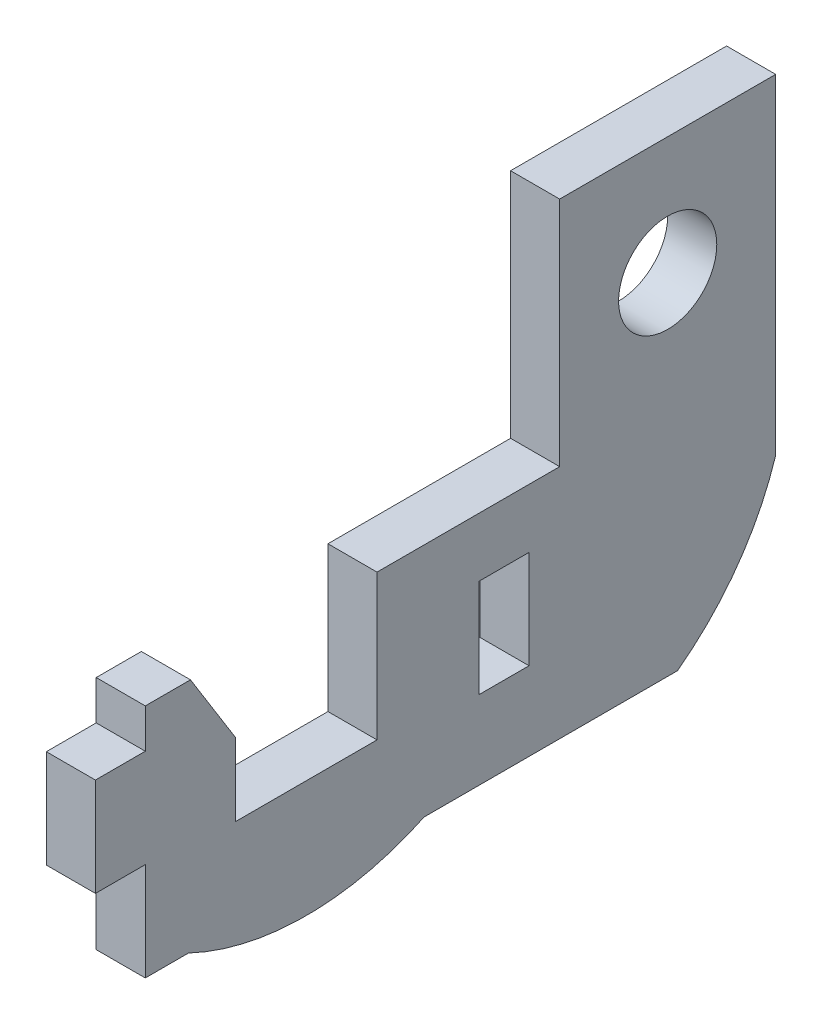
ISO-10303-21;
HEADER;
FILE_DESCRIPTION(('STEP AP214'),'2;1');
FILE_NAME('part.step','',(''),(''),'','','');
FILE_SCHEMA(('AUTOMOTIVE_DESIGN { 1 0 10303 214 1 1 1 1 }'));
ENDSEC;
DATA;
#1=APPLICATION_CONTEXT('core data for automotive mechanical design processes');
#2=APPLICATION_PROTOCOL_DEFINITION('international standard','automotive_design',2000,#1);
#3=PRODUCT_CONTEXT('',#1,'mechanical');
#4=PRODUCT('Part','Part','',(#3));
#5=PRODUCT_RELATED_PRODUCT_CATEGORY('part','',(#4));
#6=PRODUCT_DEFINITION_FORMATION('','',#4);
#7=PRODUCT_DEFINITION_CONTEXT('part definition',#1,'design');
#8=PRODUCT_DEFINITION('design','',#6,#7);
#9=PRODUCT_DEFINITION_SHAPE('','',#8);
#10=(LENGTH_UNIT() NAMED_UNIT(*) SI_UNIT(.MILLI.,.METRE.));
#11=(NAMED_UNIT(*) PLANE_ANGLE_UNIT() SI_UNIT($,.RADIAN.));
#12=(NAMED_UNIT(*) SI_UNIT($,.STERADIAN.) SOLID_ANGLE_UNIT());
#13=UNCERTAINTY_MEASURE_WITH_UNIT(LENGTH_MEASURE(1.E-05),#10,'distance_accuracy_value','');
#14=(GEOMETRIC_REPRESENTATION_CONTEXT(3) GLOBAL_UNCERTAINTY_ASSIGNED_CONTEXT((#13)) GLOBAL_UNIT_ASSIGNED_CONTEXT((#10,
#11,#12)) REPRESENTATION_CONTEXT('',''));
#15=CARTESIAN_POINT('',(0.,0.,0.));
#16=DIRECTION('',(0.,0.,1.));
#17=DIRECTION('',(1.,0.,0.));
#18=AXIS2_PLACEMENT_3D('',#15,#16,#17);
#19=CARTESIAN_POINT('',(3.175,-22.606,33.782));
#20=DIRECTION('',(0.,1.,0.));
#21=DIRECTION('',(0.,0.,1.));
#22=AXIS2_PLACEMENT_3D('',#19,#20,#21);
#23=PLANE('',#22);
#24=DIRECTION('',(0.,0.,-1.));
#25=VECTOR('',#24,1.);
#26=CARTESIAN_POINT('',(0.,-22.606,33.782));
#27=LINE('',#26,#25);
#28=CARTESIAN_POINT('',(0.,-22.606,15.748));
#29=VERTEX_POINT('',#28);
#30=CARTESIAN_POINT('',(0.,-22.606,-0.634999999999901));
#31=VERTEX_POINT('',#30);
#32=EDGE_CURVE('E194',#29,#31,#27,.T.);
#33=ORIENTED_EDGE('',*,*,#32,.T.);
#34=DIRECTION('',(-1.,0.,0.));
#35=VECTOR('',#34,1.);
#36=CARTESIAN_POINT('',(3.175,-22.606,-0.634999999999901));
#37=LINE('',#36,#35);
#38=CARTESIAN_POINT('',(3.175,-22.606,-0.634999999999901));
#39=VERTEX_POINT('',#38);
#40=EDGE_CURVE('E183',#39,#31,#37,.T.);
#41=ORIENTED_EDGE('',*,*,#40,.F.);
#42=DIRECTION('',(0.,0.,-1.));
#43=VECTOR('',#42,1.);
#44=CARTESIAN_POINT('',(3.175,-22.606,33.782));
#45=LINE('',#44,#43);
#46=CARTESIAN_POINT('',(3.175,-22.606,15.748));
#47=VERTEX_POINT('',#46);
#48=EDGE_CURVE('E192',#47,#39,#45,.T.);
#49=ORIENTED_EDGE('',*,*,#48,.F.);
#50=DIRECTION('',(-1.,0.,0.));
#51=VECTOR('',#50,1.);
#52=CARTESIAN_POINT('',(3.175,-22.606,15.748));
#53=LINE('',#52,#51);
#54=EDGE_CURVE('E335',#47,#29,#53,.T.);
#55=ORIENTED_EDGE('',*,*,#54,.T.);
#56=EDGE_LOOP('',(#33,#41,#49,#55));
#57=FACE_BOUND('',#56,.T.);
#58=ADVANCED_FACE('F33',(#57),#23,.F.);
#59=CARTESIAN_POINT('',(3.175,-7.366,6.98500000000005));
#60=DIRECTION('',(-1.,0.,0.));
#61=DIRECTION('',(0.,0.,1.));
#62=AXIS2_PLACEMENT_3D('',#59,#60,#61);
#63=PLANE('',#62);
#64=CARTESIAN_POINT('',(3.175,0.,0.));
#65=DIRECTION('',(1.,0.,0.));
#66=DIRECTION('',(0.,0.,-1.));
#67=AXIS2_PLACEMENT_3D('',#64,#65,#66);
#68=CIRCLE('',#67,3.175);
#69=CARTESIAN_POINT('',(3.175,0.,-3.175));
#70=VERTEX_POINT('',#69);
#71=EDGE_CURVE('E218',#70,#70,#68,.T.);
#72=ORIENTED_EDGE('',*,*,#71,.F.);
#73=EDGE_LOOP('',(#72));
#74=FACE_BOUND('',#73,.T.);
#75=ORIENTED_EDGE('',*,*,#48,.T.);
#76=CARTESIAN_POINT('',(3.175,-8.32639222260821,9.95845088834861));
#77=DIRECTION('',(1.,0.,0.));
#78=DIRECTION('',(0.,0.,1.));
#79=AXIS2_PLACEMENT_3D('',#76,#77,#78);
#80=CIRCLE('',#79,17.78);
#81=CARTESIAN_POINT('',(3.175,-13.716,-6.9849999999999));
#82=VERTEX_POINT('',#81);
#83=EDGE_CURVE('E180',#39,#82,#80,.T.);
#84=ORIENTED_EDGE('',*,*,#83,.T.);
#85=DIRECTION('',(0.,1.,0.));
#86=VECTOR('',#85,1.);
#87=CARTESIAN_POINT('',(3.175,-22.606,-6.9849999999999));
#88=LINE('',#87,#86);
#89=CARTESIAN_POINT('',(3.175,7.62,-6.985));
#90=VERTEX_POINT('',#89);
#91=EDGE_CURVE('E205',#82,#90,#88,.T.);
#92=ORIENTED_EDGE('',*,*,#91,.T.);
#93=DIRECTION('',(0.,0.,1.));
#94=VECTOR('',#93,1.);
#95=CARTESIAN_POINT('',(3.175,7.62,6.985));
#96=LINE('',#95,#94);
#97=CARTESIAN_POINT('',(3.175,7.62,6.985));
#98=VERTEX_POINT('',#97);
#99=EDGE_CURVE('E211',#90,#98,#96,.T.);
#100=ORIENTED_EDGE('',*,*,#99,.T.);
#101=DIRECTION('',(0.,-1.,0.));
#102=VECTOR('',#101,1.);
#103=CARTESIAN_POINT('',(3.175,7.62,6.985));
#104=LINE('',#103,#102);
#105=CARTESIAN_POINT('',(3.175,-7.366,6.98500000000005));
#106=VERTEX_POINT('',#105);
#107=EDGE_CURVE('E245',#98,#106,#104,.T.);
#108=ORIENTED_EDGE('',*,*,#107,.T.);
#109=DIRECTION('',(0.,0.,1.));
#110=VECTOR('',#109,1.);
#111=CARTESIAN_POINT('',(3.175,-7.366,6.98500000000005));
#112=LINE('',#111,#110);
#113=CARTESIAN_POINT('',(3.175,-7.366,18.796));
#114=VERTEX_POINT('',#113);
#115=EDGE_CURVE('E383',#106,#114,#112,.T.);
#116=ORIENTED_EDGE('',*,*,#115,.T.);
#117=DIRECTION('',(0.,-1.,0.));
#118=VECTOR('',#117,1.);
#119=CARTESIAN_POINT('',(3.175,-7.366,18.796));
#120=LINE('',#119,#118);
#121=CARTESIAN_POINT('',(3.175,-16.764,18.796));
#122=VERTEX_POINT('',#121);
#123=EDGE_CURVE('E281',#114,#122,#120,.T.);
#124=ORIENTED_EDGE('',*,*,#123,.T.);
#125=DIRECTION('',(0.,0.,1.));
#126=VECTOR('',#125,1.);
#127=CARTESIAN_POINT('',(3.175,-16.764,18.796));
#128=LINE('',#127,#126);
#129=CARTESIAN_POINT('',(3.175,-16.764,27.94));
#130=VERTEX_POINT('',#129);
#131=EDGE_CURVE('E302',#122,#130,#128,.T.);
#132=ORIENTED_EDGE('',*,*,#131,.T.);
#133=DIRECTION('',(0.,1.,0.));
#134=VECTOR('',#133,1.);
#135=CARTESIAN_POINT('',(3.175,-16.764,27.94));
#136=LINE('',#135,#134);
#137=CARTESIAN_POINT('',(3.175,-12.065,27.94));
#138=VERTEX_POINT('',#137);
#139=EDGE_CURVE('E298',#130,#138,#136,.T.);
#140=ORIENTED_EDGE('',*,*,#139,.T.);
#141=DIRECTION('',(0.,0.849285325289044,0.527934121125622));
#142=VECTOR('',#141,1.);
#143=CARTESIAN_POINT('',(3.175,-7.366,30.861));
#144=LINE('',#143,#142);
#145=CARTESIAN_POINT('',(3.175,-7.366,30.861));
#146=VERTEX_POINT('',#145);
#147=EDGE_CURVE('E398',#138,#146,#144,.T.);
#148=ORIENTED_EDGE('',*,*,#147,.T.);
#149=DIRECTION('',(0.,0.,1.));
#150=VECTOR('',#149,1.);
#151=CARTESIAN_POINT('',(3.175,-7.366,27.94));
#152=LINE('',#151,#150);
#153=CARTESIAN_POINT('',(3.175,-7.366,33.782));
#154=VERTEX_POINT('',#153);
#155=EDGE_CURVE('E301',#146,#154,#152,.T.);
#156=ORIENTED_EDGE('',*,*,#155,.T.);
#157=DIRECTION('',(0.,-1.,0.));
#158=VECTOR('',#157,1.);
#159=CARTESIAN_POINT('',(3.175,-7.366,33.782));
#160=LINE('',#159,#158);
#161=CARTESIAN_POINT('',(3.175,-9.90600000000001,33.782));
#162=VERTEX_POINT('',#161);
#163=EDGE_CURVE('E304',#154,#162,#160,.T.);
#164=ORIENTED_EDGE('',*,*,#163,.T.);
#165=DIRECTION('',(0.,0.,1.));
#166=VECTOR('',#165,1.);
#167=CARTESIAN_POINT('',(3.175,-9.90600000000001,33.782));
#168=LINE('',#167,#166);
#169=CARTESIAN_POINT('',(3.175,-9.90600000000001,37.0078));
#170=VERTEX_POINT('',#169);
#171=EDGE_CURVE('E310',#162,#170,#168,.T.);
#172=ORIENTED_EDGE('',*,*,#171,.T.);
#173=DIRECTION('',(0.,-1.,0.));
#174=VECTOR('',#173,1.);
#175=CARTESIAN_POINT('',(3.175,-9.90600000000001,37.0078));
#176=LINE('',#175,#174);
#177=CARTESIAN_POINT('',(3.175,-16.256,37.0078));
#178=VERTEX_POINT('',#177);
#179=EDGE_CURVE('E312',#170,#178,#176,.T.);
#180=ORIENTED_EDGE('',*,*,#179,.T.);
#181=DIRECTION('',(0.,0.,-1.));
#182=VECTOR('',#181,1.);
#183=CARTESIAN_POINT('',(3.175,-16.256,37.0078));
#184=LINE('',#183,#182);
#185=CARTESIAN_POINT('',(3.175,-16.256,33.782));
#186=VERTEX_POINT('',#185);
#187=EDGE_CURVE('E206',#178,#186,#184,.T.);
#188=ORIENTED_EDGE('',*,*,#187,.T.);
#189=DIRECTION('',(0.,-1.,0.));
#190=VECTOR('',#189,1.);
#191=CARTESIAN_POINT('',(3.175,-16.256,33.782));
#192=LINE('',#191,#190);
#193=CARTESIAN_POINT('',(3.175,-22.606,33.782));
#194=VERTEX_POINT('',#193);
#195=EDGE_CURVE('E203',#186,#194,#192,.T.);
#196=ORIENTED_EDGE('',*,*,#195,.T.);
#197=CARTESIAN_POINT('',(3.175,-22.606,30.988));
#198=VERTEX_POINT('',#197);
#199=EDGE_CURVE('E202',#194,#198,#45,.T.);
#200=ORIENTED_EDGE('',*,*,#199,.T.);
#201=CARTESIAN_POINT('',(3.175,-6.54162948634464,23.368));
#202=DIRECTION('',(-1.,0.,0.));
#203=DIRECTION('',(0.,0.,1.));
#204=AXIS2_PLACEMENT_3D('',#201,#202,#203);
#205=CIRCLE('',#204,17.78);
#206=EDGE_CURVE('E201',#47,#198,#205,.T.);
#207=ORIENTED_EDGE('',*,*,#206,.F.);
#208=EDGE_LOOP('',(#75,#84,#92,#100,#108,#116,#124,#132,#140,#148,#156,#164,#172,#180,#188,#196,
#200,#207));
#209=FACE_BOUND('',#208,.T.);
#210=DIRECTION('',(0.,-1.,0.));
#211=VECTOR('',#210,1.);
#212=CARTESIAN_POINT('',(3.175,-11.176,12.192));
#213=LINE('',#212,#211);
#214=CARTESIAN_POINT('',(3.175,-11.176,12.192));
#215=VERTEX_POINT('',#214);
#216=CARTESIAN_POINT('',(3.175,-17.526,12.192));
#217=VERTEX_POINT('',#216);
#218=EDGE_CURVE('E346',#215,#217,#213,.T.);
#219=ORIENTED_EDGE('',*,*,#218,.F.);
#220=DIRECTION('',(0.,0.,1.));
#221=VECTOR('',#220,1.);
#222=CARTESIAN_POINT('',(3.175,-11.176,8.9662));
#223=LINE('',#222,#221);
#224=CARTESIAN_POINT('',(3.175,-11.176,8.9662));
#225=VERTEX_POINT('',#224);
#226=EDGE_CURVE('E354',#225,#215,#223,.T.);
#227=ORIENTED_EDGE('',*,*,#226,.F.);
#228=DIRECTION('',(0.,1.,0.));
#229=VECTOR('',#228,1.);
#230=CARTESIAN_POINT('',(3.175,-11.176,8.9662));
#231=LINE('',#230,#229);
#232=CARTESIAN_POINT('',(3.175,-17.526,8.96619999999999));
#233=VERTEX_POINT('',#232);
#234=EDGE_CURVE('E351',#233,#225,#231,.T.);
#235=ORIENTED_EDGE('',*,*,#234,.F.);
#236=DIRECTION('',(0.,0.,-1.));
#237=VECTOR('',#236,1.);
#238=CARTESIAN_POINT('',(3.175,-17.526,8.96619999999999));
#239=LINE('',#238,#237);
#240=EDGE_CURVE('E348',#217,#233,#239,.T.);
#241=ORIENTED_EDGE('',*,*,#240,.F.);
#242=EDGE_LOOP('',(#219,#227,#235,#241));
#243=FACE_BOUND('',#242,.T.);
#244=ADVANCED_FACE('F197',(#74,#209,#243),#63,.F.);
#245=CARTESIAN_POINT('',(0.,-7.366,6.98500000000005));
#246=DIRECTION('',(-1.,0.,0.));
#247=DIRECTION('',(0.,0.,1.));
#248=AXIS2_PLACEMENT_3D('',#245,#246,#247);
#249=PLANE('',#248);
#250=CARTESIAN_POINT('',(0.,-8.32639222260821,9.95845088834861));
#251=DIRECTION('',(1.,0.,0.));
#252=DIRECTION('',(0.,0.,1.));
#253=AXIS2_PLACEMENT_3D('',#250,#251,#252);
#254=CIRCLE('',#253,17.78);
#255=CARTESIAN_POINT('',(0.,-13.716,-6.98499999999993));
#256=VERTEX_POINT('',#255);
#257=EDGE_CURVE('E48',#31,#256,#254,.T.);
#258=ORIENTED_EDGE('',*,*,#257,.F.);
#259=ORIENTED_EDGE('',*,*,#32,.F.);
#260=CARTESIAN_POINT('',(0.,-6.54162948634464,23.368));
#261=DIRECTION('',(-1.,0.,0.));
#262=DIRECTION('',(0.,0.,1.));
#263=AXIS2_PLACEMENT_3D('',#260,#261,#262);
#264=CIRCLE('',#263,17.78);
#265=CARTESIAN_POINT('',(0.,-22.606,30.988));
#266=VERTEX_POINT('',#265);
#267=EDGE_CURVE('E336',#29,#266,#264,.T.);
#268=ORIENTED_EDGE('',*,*,#267,.T.);
#269=CARTESIAN_POINT('',(0.,-22.606,33.782));
#270=VERTEX_POINT('',#269);
#271=EDGE_CURVE('E239',#270,#266,#27,.T.);
#272=ORIENTED_EDGE('',*,*,#271,.F.);
#273=DIRECTION('',(0.,-1.,0.));
#274=VECTOR('',#273,1.);
#275=CARTESIAN_POINT('',(0.,-16.256,33.782));
#276=LINE('',#275,#274);
#277=CARTESIAN_POINT('',(0.,-16.256,33.782));
#278=VERTEX_POINT('',#277);
#279=EDGE_CURVE('E237',#278,#270,#276,.T.);
#280=ORIENTED_EDGE('',*,*,#279,.F.);
#281=DIRECTION('',(0.,0.,-1.));
#282=VECTOR('',#281,1.);
#283=CARTESIAN_POINT('',(0.,-16.256,37.0078));
#284=LINE('',#283,#282);
#285=CARTESIAN_POINT('',(0.,-16.256,37.0078));
#286=VERTEX_POINT('',#285);
#287=EDGE_CURVE('E235',#286,#278,#284,.T.);
#288=ORIENTED_EDGE('',*,*,#287,.F.);
#289=DIRECTION('',(0.,-1.,0.));
#290=VECTOR('',#289,1.);
#291=CARTESIAN_POINT('',(0.,-9.90600000000001,37.0078));
#292=LINE('',#291,#290);
#293=CARTESIAN_POINT('',(0.,-9.90600000000001,37.0078));
#294=VERTEX_POINT('',#293);
#295=EDGE_CURVE('E233',#294,#286,#292,.T.);
#296=ORIENTED_EDGE('',*,*,#295,.F.);
#297=DIRECTION('',(0.,0.,1.));
#298=VECTOR('',#297,1.);
#299=CARTESIAN_POINT('',(0.,-9.90600000000001,33.782));
#300=LINE('',#299,#298);
#301=CARTESIAN_POINT('',(0.,-9.90600000000001,33.782));
#302=VERTEX_POINT('',#301);
#303=EDGE_CURVE('E231',#302,#294,#300,.T.);
#304=ORIENTED_EDGE('',*,*,#303,.F.);
#305=DIRECTION('',(0.,-1.,0.));
#306=VECTOR('',#305,1.);
#307=CARTESIAN_POINT('',(0.,-7.366,33.782));
#308=LINE('',#307,#306);
#309=CARTESIAN_POINT('',(0.,-7.366,33.782));
#310=VERTEX_POINT('',#309);
#311=EDGE_CURVE('E229',#310,#302,#308,.T.);
#312=ORIENTED_EDGE('',*,*,#311,.F.);
#313=DIRECTION('',(0.,0.,1.));
#314=VECTOR('',#313,1.);
#315=CARTESIAN_POINT('',(0.,-7.366,27.94));
#316=LINE('',#315,#314);
#317=CARTESIAN_POINT('',(0.,-7.366,30.861));
#318=VERTEX_POINT('',#317);
#319=EDGE_CURVE('E227',#318,#310,#316,.T.);
#320=ORIENTED_EDGE('',*,*,#319,.F.);
#321=DIRECTION('',(0.,0.849285325289044,0.527934121125622));
#322=VECTOR('',#321,1.);
#323=CARTESIAN_POINT('',(0.,-7.366,30.861));
#324=LINE('',#323,#322);
#325=CARTESIAN_POINT('',(0.,-12.065,27.94));
#326=VERTEX_POINT('',#325);
#327=EDGE_CURVE('E56',#326,#318,#324,.T.);
#328=ORIENTED_EDGE('',*,*,#327,.F.);
#329=DIRECTION('',(0.,1.,0.));
#330=VECTOR('',#329,1.);
#331=CARTESIAN_POINT('',(0.,-16.764,27.94));
#332=LINE('',#331,#330);
#333=CARTESIAN_POINT('',(0.,-16.764,27.94));
#334=VERTEX_POINT('',#333);
#335=EDGE_CURVE('E224',#334,#326,#332,.T.);
#336=ORIENTED_EDGE('',*,*,#335,.F.);
#337=DIRECTION('',(0.,0.,1.));
#338=VECTOR('',#337,1.);
#339=CARTESIAN_POINT('',(0.,-16.764,18.796));
#340=LINE('',#339,#338);
#341=CARTESIAN_POINT('',(0.,-16.764,18.796));
#342=VERTEX_POINT('',#341);
#343=EDGE_CURVE('E222',#342,#334,#340,.T.);
#344=ORIENTED_EDGE('',*,*,#343,.F.);
#345=DIRECTION('',(0.,-1.,0.));
#346=VECTOR('',#345,1.);
#347=CARTESIAN_POINT('',(0.,-7.366,18.796));
#348=LINE('',#347,#346);
#349=CARTESIAN_POINT('',(0.,-7.366,18.796));
#350=VERTEX_POINT('',#349);
#351=EDGE_CURVE('E220',#350,#342,#348,.T.);
#352=ORIENTED_EDGE('',*,*,#351,.F.);
#353=DIRECTION('',(0.,0.,1.));
#354=VECTOR('',#353,1.);
#355=CARTESIAN_POINT('',(0.,-7.366,6.98500000000005));
#356=LINE('',#355,#354);
#357=CARTESIAN_POINT('',(0.,-7.366,6.98500000000005));
#358=VERTEX_POINT('',#357);
#359=EDGE_CURVE('E217',#358,#350,#356,.T.);
#360=ORIENTED_EDGE('',*,*,#359,.F.);
#361=DIRECTION('',(0.,-1.,0.));
#362=VECTOR('',#361,1.);
#363=CARTESIAN_POINT('',(0.,7.62,6.985));
#364=LINE('',#363,#362);
#365=CARTESIAN_POINT('',(0.,7.62,6.985));
#366=VERTEX_POINT('',#365);
#367=EDGE_CURVE('E214',#366,#358,#364,.T.);
#368=ORIENTED_EDGE('',*,*,#367,.F.);
#369=DIRECTION('',(0.,0.,1.));
#370=VECTOR('',#369,1.);
#371=CARTESIAN_POINT('',(0.,7.62,6.985));
#372=LINE('',#371,#370);
#373=CARTESIAN_POINT('',(0.,7.62,-6.985));
#374=VERTEX_POINT('',#373);
#375=EDGE_CURVE('E243',#374,#366,#372,.T.);
#376=ORIENTED_EDGE('',*,*,#375,.F.);
#377=DIRECTION('',(0.,1.,0.));
#378=VECTOR('',#377,1.);
#379=CARTESIAN_POINT('',(0.,-22.606,-6.9849999999999));
#380=LINE('',#379,#378);
#381=EDGE_CURVE('E241',#256,#374,#380,.T.);
#382=ORIENTED_EDGE('',*,*,#381,.F.);
#383=EDGE_LOOP('',(#258,#259,#268,#272,#280,#288,#296,#304,#312,#320,#328,#336,#344,#352,#360,
#368,#376,#382));
#384=FACE_BOUND('',#383,.T.);
#385=CARTESIAN_POINT('',(0.,0.,0.));
#386=DIRECTION('',(1.,0.,0.));
#387=DIRECTION('',(0.,0.,-1.));
#388=AXIS2_PLACEMENT_3D('',#385,#386,#387);
#389=CIRCLE('',#388,3.175);
#390=CARTESIAN_POINT('',(0.,0.,-3.175));
#391=VERTEX_POINT('',#390);
#392=EDGE_CURVE('E376',#391,#391,#389,.T.);
#393=ORIENTED_EDGE('',*,*,#392,.T.);
#394=EDGE_LOOP('',(#393));
#395=FACE_BOUND('',#394,.T.);
#396=DIRECTION('',(0.,0.,1.));
#397=VECTOR('',#396,1.);
#398=CARTESIAN_POINT('',(0.,-11.176,8.9662));
#399=LINE('',#398,#397);
#400=CARTESIAN_POINT('',(0.,-11.176,8.9662));
#401=VERTEX_POINT('',#400);
#402=CARTESIAN_POINT('',(0.,-11.176,12.192));
#403=VERTEX_POINT('',#402);
#404=EDGE_CURVE('E349',#401,#403,#399,.T.);
#405=ORIENTED_EDGE('',*,*,#404,.T.);
#406=DIRECTION('',(0.,-1.,0.));
#407=VECTOR('',#406,1.);
#408=CARTESIAN_POINT('',(0.,-11.176,12.192));
#409=LINE('',#408,#407);
#410=CARTESIAN_POINT('',(0.,-17.526,12.192));
#411=VERTEX_POINT('',#410);
#412=EDGE_CURVE('E344',#403,#411,#409,.T.);
#413=ORIENTED_EDGE('',*,*,#412,.T.);
#414=DIRECTION('',(0.,0.,-1.));
#415=VECTOR('',#414,1.);
#416=CARTESIAN_POINT('',(0.,-17.526,8.96619999999999));
#417=LINE('',#416,#415);
#418=CARTESIAN_POINT('',(0.,-17.526,8.96619999999999));
#419=VERTEX_POINT('',#418);
#420=EDGE_CURVE('E359',#411,#419,#417,.T.);
#421=ORIENTED_EDGE('',*,*,#420,.T.);
#422=DIRECTION('',(0.,1.,0.));
#423=VECTOR('',#422,1.);
#424=CARTESIAN_POINT('',(0.,-11.176,8.9662));
#425=LINE('',#424,#423);
#426=EDGE_CURVE('E362',#419,#401,#425,.T.);
#427=ORIENTED_EDGE('',*,*,#426,.T.);
#428=EDGE_LOOP('',(#405,#413,#421,#427));
#429=FACE_BOUND('',#428,.T.);
#430=ADVANCED_FACE('F285',(#384,#395,#429),#249,.T.);
#431=CARTESIAN_POINT('',(3.175,7.62,6.985));
#432=DIRECTION('',(0.,0.,-1.));
#433=DIRECTION('',(0.,1.,0.));
#434=AXIS2_PLACEMENT_3D('',#431,#432,#433);
#435=PLANE('',#434);
#436=ORIENTED_EDGE('',*,*,#367,.T.);
#437=DIRECTION('',(-1.,0.,0.));
#438=VECTOR('',#437,1.);
#439=CARTESIAN_POINT('',(3.175,-7.366,6.98500000000005));
#440=LINE('',#439,#438);
#441=EDGE_CURVE('E11',#106,#358,#440,.T.);
#442=ORIENTED_EDGE('',*,*,#441,.F.);
#443=ORIENTED_EDGE('',*,*,#107,.F.);
#444=DIRECTION('',(-1.,0.,0.));
#445=VECTOR('',#444,1.);
#446=CARTESIAN_POINT('',(3.175,7.62,6.985));
#447=LINE('',#446,#445);
#448=EDGE_CURVE('E213',#98,#366,#447,.T.);
#449=ORIENTED_EDGE('',*,*,#448,.T.);
#450=EDGE_LOOP('',(#436,#442,#443,#449));
#451=FACE_BOUND('',#450,.T.);
#452=ADVANCED_FACE('F35',(#451),#435,.F.);
#453=CARTESIAN_POINT('',(3.175,-7.366,6.98500000000005));
#454=DIRECTION('',(0.,-1.,0.));
#455=DIRECTION('',(0.,0.,-1.));
#456=AXIS2_PLACEMENT_3D('',#453,#454,#455);
#457=PLANE('',#456);
#458=ORIENTED_EDGE('',*,*,#359,.T.);
#459=DIRECTION('',(-1.,0.,0.));
#460=VECTOR('',#459,1.);
#461=CARTESIAN_POINT('',(3.175,-7.366,18.796));
#462=LINE('',#461,#460);
#463=EDGE_CURVE('E41',#114,#350,#462,.T.);
#464=ORIENTED_EDGE('',*,*,#463,.F.);
#465=ORIENTED_EDGE('',*,*,#115,.F.);
#466=ORIENTED_EDGE('',*,*,#441,.T.);
#467=EDGE_LOOP('',(#458,#464,#465,#466));
#468=FACE_BOUND('',#467,.T.);
#469=ADVANCED_FACE('F386',(#468),#457,.F.);
#470=CARTESIAN_POINT('',(3.175,-7.366,18.796));
#471=DIRECTION('',(0.,0.,-1.));
#472=DIRECTION('',(-1.,0.,0.));
#473=AXIS2_PLACEMENT_3D('',#470,#471,#472);
#474=PLANE('',#473);
#475=ORIENTED_EDGE('',*,*,#351,.T.);
#476=DIRECTION('',(-1.,0.,0.));
#477=VECTOR('',#476,1.);
#478=CARTESIAN_POINT('',(3.175,-16.764,18.796));
#479=LINE('',#478,#477);
#480=EDGE_CURVE('E272',#122,#342,#479,.T.);
#481=ORIENTED_EDGE('',*,*,#480,.F.);
#482=ORIENTED_EDGE('',*,*,#123,.F.);
#483=ORIENTED_EDGE('',*,*,#463,.T.);
#484=EDGE_LOOP('',(#475,#481,#482,#483));
#485=FACE_BOUND('',#484,.T.);
#486=ADVANCED_FACE('F279',(#485),#474,.F.);
#487=CARTESIAN_POINT('',(3.175,-16.764,18.796));
#488=DIRECTION('',(0.,-1.,0.));
#489=DIRECTION('',(0.,0.,-1.));
#490=AXIS2_PLACEMENT_3D('',#487,#488,#489);
#491=PLANE('',#490);
#492=ORIENTED_EDGE('',*,*,#343,.T.);
#493=DIRECTION('',(-1.,0.,0.));
#494=VECTOR('',#493,1.);
#495=CARTESIAN_POINT('',(3.175,-16.764,27.94));
#496=LINE('',#495,#494);
#497=EDGE_CURVE('E269',#130,#334,#496,.T.);
#498=ORIENTED_EDGE('',*,*,#497,.F.);
#499=ORIENTED_EDGE('',*,*,#131,.F.);
#500=ORIENTED_EDGE('',*,*,#480,.T.);
#501=EDGE_LOOP('',(#492,#498,#499,#500));
#502=FACE_BOUND('',#501,.T.);
#503=ADVANCED_FACE('F291',(#502),#491,.F.);
#504=CARTESIAN_POINT('',(3.175,-16.764,27.94));
#505=DIRECTION('',(0.,0.,1.));
#506=DIRECTION('',(1.,0.,0.));
#507=AXIS2_PLACEMENT_3D('',#504,#505,#506);
#508=PLANE('',#507);
#509=ORIENTED_EDGE('',*,*,#335,.T.);
#510=DIRECTION('',(-1.,0.,0.));
#511=VECTOR('',#510,1.);
#512=CARTESIAN_POINT('',(3.175,-12.065,27.94));
#513=LINE('',#512,#511);
#514=EDGE_CURVE('E299',#138,#326,#513,.T.);
#515=ORIENTED_EDGE('',*,*,#514,.F.);
#516=ORIENTED_EDGE('',*,*,#139,.F.);
#517=ORIENTED_EDGE('',*,*,#497,.T.);
#518=EDGE_LOOP('',(#509,#515,#516,#517));
#519=FACE_BOUND('',#518,.T.);
#520=ADVANCED_FACE('F295',(#519),#508,.F.);
#521=CARTESIAN_POINT('',(3.175,-7.366,27.94));
#522=DIRECTION('',(0.,-1.,0.));
#523=DIRECTION('',(0.,0.,-1.));
#524=AXIS2_PLACEMENT_3D('',#521,#522,#523);
#525=PLANE('',#524);
#526=ORIENTED_EDGE('',*,*,#155,.F.);
#527=DIRECTION('',(-1.,0.,0.));
#528=VECTOR('',#527,1.);
#529=CARTESIAN_POINT('',(3.175,-7.366,30.861));
#530=LINE('',#529,#528);
#531=EDGE_CURVE('E339',#146,#318,#530,.T.);
#532=ORIENTED_EDGE('',*,*,#531,.T.);
#533=ORIENTED_EDGE('',*,*,#319,.T.);
#534=DIRECTION('',(-1.,0.,0.));
#535=VECTOR('',#534,1.);
#536=CARTESIAN_POINT('',(3.175,-7.366,33.782));
#537=LINE('',#536,#535);
#538=EDGE_CURVE('E266',#154,#310,#537,.T.);
#539=ORIENTED_EDGE('',*,*,#538,.F.);
#540=EDGE_LOOP('',(#526,#532,#533,#539));
#541=FACE_BOUND('',#540,.T.);
#542=ADVANCED_FACE('F409',(#541),#525,.F.);
#543=CARTESIAN_POINT('',(3.175,-7.366,33.782));
#544=DIRECTION('',(0.,0.,-1.));
#545=DIRECTION('',(0.,1.,0.));
#546=AXIS2_PLACEMENT_3D('',#543,#544,#545);
#547=PLANE('',#546);
#548=ORIENTED_EDGE('',*,*,#311,.T.);
#549=DIRECTION('',(-1.,0.,0.));
#550=VECTOR('',#549,1.);
#551=CARTESIAN_POINT('',(3.175,-9.90600000000001,33.782));
#552=LINE('',#551,#550);
#553=EDGE_CURVE('E263',#162,#302,#552,.T.);
#554=ORIENTED_EDGE('',*,*,#553,.F.);
#555=ORIENTED_EDGE('',*,*,#163,.F.);
#556=ORIENTED_EDGE('',*,*,#538,.T.);
#557=EDGE_LOOP('',(#548,#554,#555,#556));
#558=FACE_BOUND('',#557,.T.);
#559=ADVANCED_FACE('F412',(#558),#547,.F.);
#560=CARTESIAN_POINT('',(3.175,-9.90600000000001,33.782));
#561=DIRECTION('',(0.,-1.,0.));
#562=DIRECTION('',(0.,0.,-1.));
#563=AXIS2_PLACEMENT_3D('',#560,#561,#562);
#564=PLANE('',#563);
#565=ORIENTED_EDGE('',*,*,#303,.T.);
#566=DIRECTION('',(-1.,0.,0.));
#567=VECTOR('',#566,1.);
#568=CARTESIAN_POINT('',(3.175,-9.90600000000001,37.0078));
#569=LINE('',#568,#567);
#570=EDGE_CURVE('E260',#170,#294,#569,.T.);
#571=ORIENTED_EDGE('',*,*,#570,.F.);
#572=ORIENTED_EDGE('',*,*,#171,.F.);
#573=ORIENTED_EDGE('',*,*,#553,.T.);
#574=EDGE_LOOP('',(#565,#571,#572,#573));
#575=FACE_BOUND('',#574,.T.);
#576=ADVANCED_FACE('F417',(#575),#564,.F.);
#577=CARTESIAN_POINT('',(3.175,-9.90600000000001,37.0078));
#578=DIRECTION('',(0.,0.,-1.));
#579=DIRECTION('',(-1.,0.,0.));
#580=AXIS2_PLACEMENT_3D('',#577,#578,#579);
#581=PLANE('',#580);
#582=ORIENTED_EDGE('',*,*,#295,.T.);
#583=DIRECTION('',(-1.,0.,0.));
#584=VECTOR('',#583,1.);
#585=CARTESIAN_POINT('',(3.175,-16.256,37.0078));
#586=LINE('',#585,#584);
#587=EDGE_CURVE('E257',#178,#286,#586,.T.);
#588=ORIENTED_EDGE('',*,*,#587,.F.);
#589=ORIENTED_EDGE('',*,*,#179,.F.);
#590=ORIENTED_EDGE('',*,*,#570,.T.);
#591=EDGE_LOOP('',(#582,#588,#589,#590));
#592=FACE_BOUND('',#591,.T.);
#593=ADVANCED_FACE('F420',(#592),#581,.F.);
#594=CARTESIAN_POINT('',(3.175,-16.256,37.0078));
#595=DIRECTION('',(0.,1.,0.));
#596=DIRECTION('',(0.,0.,1.));
#597=AXIS2_PLACEMENT_3D('',#594,#595,#596);
#598=PLANE('',#597);
#599=ORIENTED_EDGE('',*,*,#287,.T.);
#600=DIRECTION('',(-1.,0.,0.));
#601=VECTOR('',#600,1.);
#602=CARTESIAN_POINT('',(3.175,-16.256,33.782));
#603=LINE('',#602,#601);
#604=EDGE_CURVE('E254',#186,#278,#603,.T.);
#605=ORIENTED_EDGE('',*,*,#604,.F.);
#606=ORIENTED_EDGE('',*,*,#187,.F.);
#607=ORIENTED_EDGE('',*,*,#587,.T.);
#608=EDGE_LOOP('',(#599,#605,#606,#607));
#609=FACE_BOUND('',#608,.T.);
#610=ADVANCED_FACE('F320',(#609),#598,.F.);
#611=CARTESIAN_POINT('',(3.175,-16.256,33.782));
#612=DIRECTION('',(0.,0.,-1.));
#613=DIRECTION('',(0.,1.,0.));
#614=AXIS2_PLACEMENT_3D('',#611,#612,#613);
#615=PLANE('',#614);
#616=ORIENTED_EDGE('',*,*,#279,.T.);
#617=DIRECTION('',(-1.,0.,0.));
#618=VECTOR('',#617,1.);
#619=CARTESIAN_POINT('',(3.175,-22.606,33.782));
#620=LINE('',#619,#618);
#621=EDGE_CURVE('E251',#194,#270,#620,.T.);
#622=ORIENTED_EDGE('',*,*,#621,.F.);
#623=ORIENTED_EDGE('',*,*,#195,.F.);
#624=ORIENTED_EDGE('',*,*,#604,.T.);
#625=EDGE_LOOP('',(#616,#622,#623,#624));
#626=FACE_BOUND('',#625,.T.);
#627=ADVANCED_FACE('F324',(#626),#615,.F.);
#628=ORIENTED_EDGE('',*,*,#271,.T.);
#629=DIRECTION('',(-1.,0.,0.));
#630=VECTOR('',#629,1.);
#631=CARTESIAN_POINT('',(3.175,-22.606,30.988));
#632=LINE('',#631,#630);
#633=EDGE_CURVE('E330',#198,#266,#632,.T.);
#634=ORIENTED_EDGE('',*,*,#633,.F.);
#635=ORIENTED_EDGE('',*,*,#199,.F.);
#636=ORIENTED_EDGE('',*,*,#621,.T.);
#637=EDGE_LOOP('',(#628,#634,#635,#636));
#638=FACE_BOUND('',#637,.T.);
#639=ADVANCED_FACE('F328',(#638),#23,.F.);
#640=CARTESIAN_POINT('',(3.175,-22.606,-6.9849999999999));
#641=DIRECTION('',(0.,0.,1.));
#642=DIRECTION('',(0.,-1.,0.));
#643=AXIS2_PLACEMENT_3D('',#640,#641,#642);
#644=PLANE('',#643);
#645=ORIENTED_EDGE('',*,*,#91,.F.);
#646=DIRECTION('',(-1.,0.,0.));
#647=VECTOR('',#646,1.);
#648=CARTESIAN_POINT('',(3.175,-13.716,-6.9849999999999));
#649=LINE('',#648,#647);
#650=EDGE_CURVE('E184',#82,#256,#649,.T.);
#651=ORIENTED_EDGE('',*,*,#650,.T.);
#652=ORIENTED_EDGE('',*,*,#381,.T.);
#653=DIRECTION('',(-1.,0.,0.));
#654=VECTOR('',#653,1.);
#655=CARTESIAN_POINT('',(3.175,7.62,-6.985));
#656=LINE('',#655,#654);
#657=EDGE_CURVE('E248',#90,#374,#656,.T.);
#658=ORIENTED_EDGE('',*,*,#657,.F.);
#659=EDGE_LOOP('',(#645,#651,#652,#658));
#660=FACE_BOUND('',#659,.T.);
#661=ADVANCED_FACE('F396',(#660),#644,.F.);
#662=CARTESIAN_POINT('',(3.175,7.62,6.985));
#663=DIRECTION('',(0.,-1.,0.));
#664=DIRECTION('',(0.,0.,-1.));
#665=AXIS2_PLACEMENT_3D('',#662,#663,#664);
#666=PLANE('',#665);
#667=ORIENTED_EDGE('',*,*,#375,.T.);
#668=ORIENTED_EDGE('',*,*,#448,.F.);
#669=ORIENTED_EDGE('',*,*,#99,.F.);
#670=ORIENTED_EDGE('',*,*,#657,.T.);
#671=EDGE_LOOP('',(#667,#668,#669,#670));
#672=FACE_BOUND('',#671,.T.);
#673=ADVANCED_FACE('F392',(#672),#666,.F.);
#674=CARTESIAN_POINT('',(3.175,0.,0.));
#675=DIRECTION('',(-1.,0.,0.));
#676=DIRECTION('',(0.,0.,1.));
#677=AXIS2_PLACEMENT_3D('',#674,#675,#676);
#678=CYLINDRICAL_SURFACE('',#677,3.175);
#679=ORIENTED_EDGE('',*,*,#71,.T.);
#680=EDGE_LOOP('',(#679));
#681=FACE_BOUND('',#680,.T.);
#682=ORIENTED_EDGE('',*,*,#392,.F.);
#683=EDGE_LOOP('',(#682));
#684=FACE_BOUND('',#683,.T.);
#685=ADVANCED_FACE('F576',(#681,#684),#678,.F.);
#686=CARTESIAN_POINT('',(3.175,-11.176,12.192));
#687=DIRECTION('',(0.,0.,-1.));
#688=DIRECTION('',(-1.,0.,0.));
#689=AXIS2_PLACEMENT_3D('',#686,#687,#688);
#690=PLANE('',#689);
#691=ORIENTED_EDGE('',*,*,#412,.F.);
#692=DIRECTION('',(-1.,0.,0.));
#693=VECTOR('',#692,1.);
#694=CARTESIAN_POINT('',(3.175,-11.176,12.192));
#695=LINE('',#694,#693);
#696=EDGE_CURVE('E356',#215,#403,#695,.T.);
#697=ORIENTED_EDGE('',*,*,#696,.F.);
#698=ORIENTED_EDGE('',*,*,#218,.T.);
#699=DIRECTION('',(-1.,0.,0.));
#700=VECTOR('',#699,1.);
#701=CARTESIAN_POINT('',(3.175,-17.526,12.192));
#702=LINE('',#701,#700);
#703=EDGE_CURVE('E373',#217,#411,#702,.T.);
#704=ORIENTED_EDGE('',*,*,#703,.T.);
#705=EDGE_LOOP('',(#691,#697,#698,#704));
#706=FACE_BOUND('',#705,.T.);
#707=ADVANCED_FACE('F566',(#706),#690,.T.);
#708=CARTESIAN_POINT('',(3.175,-17.526,8.96619999999999));
#709=DIRECTION('',(0.,1.,0.));
#710=DIRECTION('',(0.,0.,1.));
#711=AXIS2_PLACEMENT_3D('',#708,#709,#710);
#712=PLANE('',#711);
#713=ORIENTED_EDGE('',*,*,#420,.F.);
#714=ORIENTED_EDGE('',*,*,#703,.F.);
#715=ORIENTED_EDGE('',*,*,#240,.T.);
#716=DIRECTION('',(-1.,0.,0.));
#717=VECTOR('',#716,1.);
#718=CARTESIAN_POINT('',(3.175,-17.526,8.96619999999999));
#719=LINE('',#718,#717);
#720=EDGE_CURVE('E371',#233,#419,#719,.T.);
#721=ORIENTED_EDGE('',*,*,#720,.T.);
#722=EDGE_LOOP('',(#713,#714,#715,#721));
#723=FACE_BOUND('',#722,.T.);
#724=ADVANCED_FACE('F556',(#723),#712,.T.);
#725=CARTESIAN_POINT('',(3.175,-11.176,8.9662));
#726=DIRECTION('',(0.,0.,1.));
#727=DIRECTION('',(0.,-1.,0.));
#728=AXIS2_PLACEMENT_3D('',#725,#726,#727);
#729=PLANE('',#728);
#730=ORIENTED_EDGE('',*,*,#426,.F.);
#731=ORIENTED_EDGE('',*,*,#720,.F.);
#732=ORIENTED_EDGE('',*,*,#234,.T.);
#733=DIRECTION('',(-1.,0.,0.));
#734=VECTOR('',#733,1.);
#735=CARTESIAN_POINT('',(3.175,-11.176,8.9662));
#736=LINE('',#735,#734);
#737=EDGE_CURVE('E369',#225,#401,#736,.T.);
#738=ORIENTED_EDGE('',*,*,#737,.T.);
#739=EDGE_LOOP('',(#730,#731,#732,#738));
#740=FACE_BOUND('',#739,.T.);
#741=ADVANCED_FACE('F546',(#740),#729,.T.);
#742=CARTESIAN_POINT('',(3.175,-11.176,8.9662));
#743=DIRECTION('',(0.,-1.,0.));
#744=DIRECTION('',(0.,0.,-1.));
#745=AXIS2_PLACEMENT_3D('',#742,#743,#744);
#746=PLANE('',#745);
#747=ORIENTED_EDGE('',*,*,#404,.F.);
#748=ORIENTED_EDGE('',*,*,#737,.F.);
#749=ORIENTED_EDGE('',*,*,#226,.T.);
#750=ORIENTED_EDGE('',*,*,#696,.T.);
#751=EDGE_LOOP('',(#747,#748,#749,#750));
#752=FACE_BOUND('',#751,.T.);
#753=ADVANCED_FACE('F530',(#752),#746,.T.);
#754=CARTESIAN_POINT('',(3.175,-6.54162948634464,23.368));
#755=DIRECTION('',(-1.,0.,0.));
#756=DIRECTION('',(0.,0.,1.));
#757=AXIS2_PLACEMENT_3D('',#754,#755,#756);
#758=CYLINDRICAL_SURFACE('',#757,17.78);
#759=ORIENTED_EDGE('',*,*,#267,.F.);
#760=ORIENTED_EDGE('',*,*,#54,.F.);
#761=ORIENTED_EDGE('',*,*,#206,.T.);
#762=ORIENTED_EDGE('',*,*,#633,.T.);
#763=EDGE_LOOP('',(#759,#760,#761,#762));
#764=FACE_BOUND('',#763,.T.);
#765=ADVANCED_FACE('F333',(#764),#758,.T.);
#766=CARTESIAN_POINT('',(3.175,-7.366,30.861));
#767=DIRECTION('',(0.,-0.527934121125622,0.849285325289044));
#768=DIRECTION('',(0.,-0.849285325289044,-0.527934121125622));
#769=AXIS2_PLACEMENT_3D('',#766,#767,#768);
#770=PLANE('',#769);
#771=ORIENTED_EDGE('',*,*,#327,.T.);
#772=ORIENTED_EDGE('',*,*,#531,.F.);
#773=ORIENTED_EDGE('',*,*,#147,.F.);
#774=ORIENTED_EDGE('',*,*,#514,.T.);
#775=EDGE_LOOP('',(#771,#772,#773,#774));
#776=FACE_BOUND('',#775,.T.);
#777=ADVANCED_FACE('F405',(#776),#770,.F.);
#778=CARTESIAN_POINT('',(3.175,-8.32639222260821,9.95845088834861));
#779=DIRECTION('',(-1.,0.,0.));
#780=DIRECTION('',(0.,0.,1.));
#781=AXIS2_PLACEMENT_3D('',#778,#779,#780);
#782=CYLINDRICAL_SURFACE('',#781,17.78);
#783=ORIENTED_EDGE('',*,*,#257,.T.);
#784=ORIENTED_EDGE('',*,*,#650,.F.);
#785=ORIENTED_EDGE('',*,*,#83,.F.);
#786=ORIENTED_EDGE('',*,*,#40,.T.);
#787=EDGE_LOOP('',(#783,#784,#785,#786));
#788=FACE_BOUND('',#787,.T.);
#789=ADVANCED_FACE('F182',(#788),#782,.T.);
#790=CLOSED_SHELL('',(#58,#244,#430,#452,#469,#486,#503,#520,#542,#559,#576,#593,#610,#627,#639,
#661,#673,#685,#707,#724,#741,#753,#765,#777,#789));
#791=MANIFOLD_SOLID_BREP('B2',#790);
#792=ADVANCED_BREP_SHAPE_REPRESENTATION('',(#18,#791),#14);
#793=SHAPE_DEFINITION_REPRESENTATION(#9,#792);
ENDSEC;
END-ISO-10303-21;
